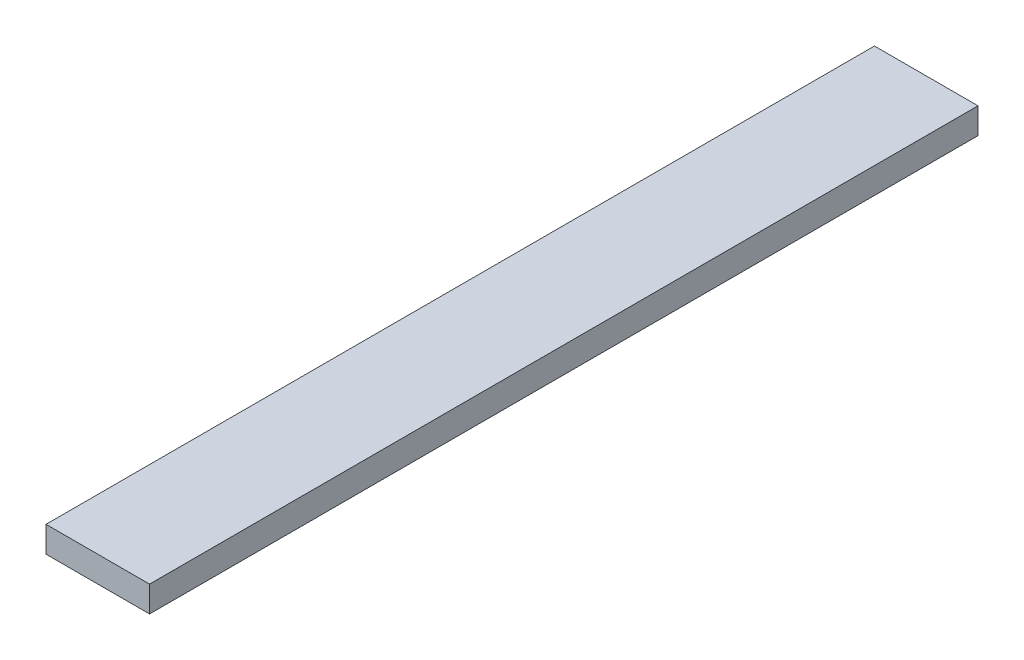
ISO-10303-21;
HEADER;
FILE_DESCRIPTION(('STEP AP214'),'2;1');
FILE_NAME('part.step','',(''),(''),'','','');
FILE_SCHEMA(('AUTOMOTIVE_DESIGN { 1 0 10303 214 1 1 1 1 }'));
ENDSEC;
DATA;
#1=APPLICATION_CONTEXT('core data for automotive mechanical design processes');
#2=APPLICATION_PROTOCOL_DEFINITION('international standard','automotive_design',2000,#1);
#3=PRODUCT_CONTEXT('',#1,'mechanical');
#4=PRODUCT('Part','Part','',(#3));
#5=PRODUCT_RELATED_PRODUCT_CATEGORY('part','',(#4));
#6=PRODUCT_DEFINITION_FORMATION('','',#4);
#7=PRODUCT_DEFINITION_CONTEXT('part definition',#1,'design');
#8=PRODUCT_DEFINITION('design','',#6,#7);
#9=PRODUCT_DEFINITION_SHAPE('','',#8);
#10=(LENGTH_UNIT() NAMED_UNIT(*) SI_UNIT(.MILLI.,.METRE.));
#11=(NAMED_UNIT(*) PLANE_ANGLE_UNIT() SI_UNIT($,.RADIAN.));
#12=(NAMED_UNIT(*) SI_UNIT($,.STERADIAN.) SOLID_ANGLE_UNIT());
#13=UNCERTAINTY_MEASURE_WITH_UNIT(LENGTH_MEASURE(1.E-05),#10,'distance_accuracy_value','');
#14=(GEOMETRIC_REPRESENTATION_CONTEXT(3) GLOBAL_UNCERTAINTY_ASSIGNED_CONTEXT((#13)) GLOBAL_UNIT_ASSIGNED_CONTEXT((#10,
#11,#12)) REPRESENTATION_CONTEXT('',''));
#15=CARTESIAN_POINT('',(0.,0.,0.));
#16=DIRECTION('',(0.,0.,1.));
#17=DIRECTION('',(1.,0.,0.));
#18=AXIS2_PLACEMENT_3D('',#15,#16,#17);
#19=CARTESIAN_POINT('',(38.1,19.05,-304.8));
#20=DIRECTION('',(-1.,0.,0.));
#21=DIRECTION('',(0.,0.,1.));
#22=AXIS2_PLACEMENT_3D('',#19,#20,#21);
#23=PLANE('',#22);
#24=DIRECTION('',(0.,0.,-1.));
#25=VECTOR('',#24,1.);
#26=CARTESIAN_POINT('',(38.1,0.,-304.8));
#27=LINE('',#26,#25);
#28=CARTESIAN_POINT('',(38.1,0.,304.8));
#29=VERTEX_POINT('',#28);
#30=CARTESIAN_POINT('',(38.1,0.,-304.8));
#31=VERTEX_POINT('',#30);
#32=EDGE_CURVE('E96',#29,#31,#27,.T.);
#33=ORIENTED_EDGE('',*,*,#32,.T.);
#34=DIRECTION('',(0.,-1.,0.));
#35=VECTOR('',#34,1.);
#36=CARTESIAN_POINT('',(38.1,19.05,-304.8));
#37=LINE('',#36,#35);
#38=CARTESIAN_POINT('',(38.1,19.05,-304.8));
#39=VERTEX_POINT('',#38);
#40=EDGE_CURVE('E11',#39,#31,#37,.T.);
#41=ORIENTED_EDGE('',*,*,#40,.F.);
#42=DIRECTION('',(0.,0.,-1.));
#43=VECTOR('',#42,1.);
#44=CARTESIAN_POINT('',(38.1,19.05,-304.8));
#45=LINE('',#44,#43);
#46=CARTESIAN_POINT('',(38.1,19.05,304.8));
#47=VERTEX_POINT('',#46);
#48=EDGE_CURVE('E84',#47,#39,#45,.T.);
#49=ORIENTED_EDGE('',*,*,#48,.F.);
#50=DIRECTION('',(0.,-1.,0.));
#51=VECTOR('',#50,1.);
#52=CARTESIAN_POINT('',(38.1,19.05,304.8));
#53=LINE('',#52,#51);
#54=EDGE_CURVE('E92',#47,#29,#53,.T.);
#55=ORIENTED_EDGE('',*,*,#54,.T.);
#56=EDGE_LOOP('',(#33,#41,#49,#55));
#57=FACE_BOUND('',#56,.T.);
#58=ADVANCED_FACE('F33',(#57),#23,.F.);
#59=CARTESIAN_POINT('',(-38.1000000000001,19.05,-304.8));
#60=DIRECTION('',(0.,0.,1.));
#61=DIRECTION('',(1.,0.,0.));
#62=AXIS2_PLACEMENT_3D('',#59,#60,#61);
#63=PLANE('',#62);
#64=DIRECTION('',(-1.,0.,0.));
#65=VECTOR('',#64,1.);
#66=CARTESIAN_POINT('',(-38.1000000000001,0.,-304.8));
#67=LINE('',#66,#65);
#68=CARTESIAN_POINT('',(-38.1000000000001,0.,-304.8));
#69=VERTEX_POINT('',#68);
#70=EDGE_CURVE('E88',#31,#69,#67,.T.);
#71=ORIENTED_EDGE('',*,*,#70,.T.);
#72=DIRECTION('',(0.,-1.,0.));
#73=VECTOR('',#72,1.);
#74=CARTESIAN_POINT('',(-38.1000000000001,19.05,-304.8));
#75=LINE('',#74,#73);
#76=CARTESIAN_POINT('',(-38.1000000000001,19.05,-304.8));
#77=VERTEX_POINT('',#76);
#78=EDGE_CURVE('E41',#77,#69,#75,.T.);
#79=ORIENTED_EDGE('',*,*,#78,.F.);
#80=DIRECTION('',(-1.,0.,0.));
#81=VECTOR('',#80,1.);
#82=CARTESIAN_POINT('',(-38.1000000000001,19.05,-304.8));
#83=LINE('',#82,#81);
#84=EDGE_CURVE('E79',#39,#77,#83,.T.);
#85=ORIENTED_EDGE('',*,*,#84,.F.);
#86=ORIENTED_EDGE('',*,*,#40,.T.);
#87=EDGE_LOOP('',(#71,#79,#85,#86));
#88=FACE_BOUND('',#87,.T.);
#89=ADVANCED_FACE('F87',(#88),#63,.F.);
#90=CARTESIAN_POINT('',(-38.1000000000001,19.05,-304.8));
#91=DIRECTION('',(1.,0.,0.));
#92=DIRECTION('',(0.,0.,-1.));
#93=AXIS2_PLACEMENT_3D('',#90,#91,#92);
#94=PLANE('',#93);
#95=DIRECTION('',(0.,0.,1.));
#96=VECTOR('',#95,1.);
#97=CARTESIAN_POINT('',(-38.1000000000001,0.,-304.8));
#98=LINE('',#97,#96);
#99=CARTESIAN_POINT('',(-38.1,0.,304.8));
#100=VERTEX_POINT('',#99);
#101=EDGE_CURVE('E66',#69,#100,#98,.T.);
#102=ORIENTED_EDGE('',*,*,#101,.T.);
#103=DIRECTION('',(0.,-1.,0.));
#104=VECTOR('',#103,1.);
#105=CARTESIAN_POINT('',(-38.1,19.05,304.8));
#106=LINE('',#105,#104);
#107=CARTESIAN_POINT('',(-38.1,19.05,304.8));
#108=VERTEX_POINT('',#107);
#109=EDGE_CURVE('E89',#108,#100,#106,.T.);
#110=ORIENTED_EDGE('',*,*,#109,.F.);
#111=DIRECTION('',(0.,0.,1.));
#112=VECTOR('',#111,1.);
#113=CARTESIAN_POINT('',(-38.1000000000001,19.05,-304.8));
#114=LINE('',#113,#112);
#115=EDGE_CURVE('E82',#77,#108,#114,.T.);
#116=ORIENTED_EDGE('',*,*,#115,.F.);
#117=ORIENTED_EDGE('',*,*,#78,.T.);
#118=EDGE_LOOP('',(#102,#110,#116,#117));
#119=FACE_BOUND('',#118,.T.);
#120=ADVANCED_FACE('F90',(#119),#94,.F.);
#121=CARTESIAN_POINT('',(-38.1,19.05,304.8));
#122=DIRECTION('',(0.,0.,-1.));
#123=DIRECTION('',(-1.,0.,0.));
#124=AXIS2_PLACEMENT_3D('',#121,#122,#123);
#125=PLANE('',#124);
#126=DIRECTION('',(1.,0.,0.));
#127=VECTOR('',#126,1.);
#128=CARTESIAN_POINT('',(-38.1,0.,304.8));
#129=LINE('',#128,#127);
#130=EDGE_CURVE('E72',#100,#29,#129,.T.);
#131=ORIENTED_EDGE('',*,*,#130,.T.);
#132=ORIENTED_EDGE('',*,*,#54,.F.);
#133=DIRECTION('',(1.,0.,0.));
#134=VECTOR('',#133,1.);
#135=CARTESIAN_POINT('',(-38.1,19.05,304.8));
#136=LINE('',#135,#134);
#137=EDGE_CURVE('E49',#108,#47,#136,.T.);
#138=ORIENTED_EDGE('',*,*,#137,.F.);
#139=ORIENTED_EDGE('',*,*,#109,.T.);
#140=EDGE_LOOP('',(#131,#132,#138,#139));
#141=FACE_BOUND('',#140,.T.);
#142=ADVANCED_FACE('F103',(#141),#125,.F.);
#143=CARTESIAN_POINT('',(38.1,19.05,304.8));
#144=DIRECTION('',(0.,1.,0.));
#145=DIRECTION('',(0.,0.,1.));
#146=AXIS2_PLACEMENT_3D('',#143,#144,#145);
#147=PLANE('',#146);
#148=ORIENTED_EDGE('',*,*,#48,.T.);
#149=ORIENTED_EDGE('',*,*,#84,.T.);
#150=ORIENTED_EDGE('',*,*,#115,.T.);
#151=ORIENTED_EDGE('',*,*,#137,.T.);
#152=EDGE_LOOP('',(#148,#149,#150,#151));
#153=FACE_BOUND('',#152,.T.);
#154=ADVANCED_FACE('F80',(#153),#147,.T.);
#155=CARTESIAN_POINT('',(38.1,0.,304.8));
#156=DIRECTION('',(0.,1.,0.));
#157=DIRECTION('',(0.,0.,1.));
#158=AXIS2_PLACEMENT_3D('',#155,#156,#157);
#159=PLANE('',#158);
#160=ORIENTED_EDGE('',*,*,#32,.F.);
#161=ORIENTED_EDGE('',*,*,#130,.F.);
#162=ORIENTED_EDGE('',*,*,#101,.F.);
#163=ORIENTED_EDGE('',*,*,#70,.F.);
#164=EDGE_LOOP('',(#160,#161,#162,#163));
#165=FACE_BOUND('',#164,.T.);
#166=ADVANCED_FACE('F106',(#165),#159,.F.);
#167=CLOSED_SHELL('',(#58,#89,#120,#142,#154,#166));
#168=MANIFOLD_SOLID_BREP('B2',#167);
#169=ADVANCED_BREP_SHAPE_REPRESENTATION('',(#18,#168),#14);
#170=SHAPE_DEFINITION_REPRESENTATION(#9,#169);
ENDSEC;
END-ISO-10303-21;
